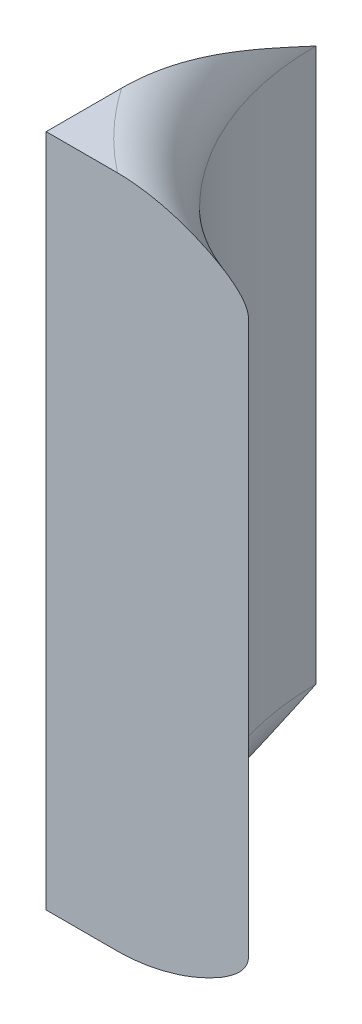
ISO-10303-21;
HEADER;
FILE_DESCRIPTION(('STEP AP214'),'2;1');
FILE_NAME('part.step','',(''),(''),'','','');
FILE_SCHEMA(('AUTOMOTIVE_DESIGN { 1 0 10303 214 1 1 1 1 }'));
ENDSEC;
DATA;
#1=APPLICATION_CONTEXT('core data for automotive mechanical design processes');
#2=APPLICATION_PROTOCOL_DEFINITION('international standard','automotive_design',2000,#1);
#3=PRODUCT_CONTEXT('',#1,'mechanical');
#4=PRODUCT('Part','Part','',(#3));
#5=PRODUCT_RELATED_PRODUCT_CATEGORY('part','',(#4));
#6=PRODUCT_DEFINITION_FORMATION('','',#4);
#7=PRODUCT_DEFINITION_CONTEXT('part definition',#1,'design');
#8=PRODUCT_DEFINITION('design','',#6,#7);
#9=PRODUCT_DEFINITION_SHAPE('','',#8);
#10=(LENGTH_UNIT() NAMED_UNIT(*) SI_UNIT(.MILLI.,.METRE.));
#11=(NAMED_UNIT(*) PLANE_ANGLE_UNIT() SI_UNIT($,.RADIAN.));
#12=(NAMED_UNIT(*) SI_UNIT($,.STERADIAN.) SOLID_ANGLE_UNIT());
#13=UNCERTAINTY_MEASURE_WITH_UNIT(LENGTH_MEASURE(1.E-05),#10,'distance_accuracy_value','');
#14=(GEOMETRIC_REPRESENTATION_CONTEXT(3) GLOBAL_UNCERTAINTY_ASSIGNED_CONTEXT((#13)) GLOBAL_UNIT_ASSIGNED_CONTEXT((#10,
#11,#12)) REPRESENTATION_CONTEXT('',''));
#15=CARTESIAN_POINT('',(0.,0.,0.));
#16=DIRECTION('',(0.,0.,1.));
#17=DIRECTION('',(1.,0.,0.));
#18=AXIS2_PLACEMENT_3D('',#15,#16,#17);
#19=CARTESIAN_POINT('',(10.4166666667,-1.59,-7.39999999999999));
#20=DIRECTION('',(0.,1.,0.));
#21=DIRECTION('',(0.,0.,1.));
#22=AXIS2_PLACEMENT_3D('',#19,#20,#21);
#23=TOROIDAL_SURFACE('',#22,0.506666666666962,0.0900000000000044);
#24=CARTESIAN_POINT('',(10.,-1.5,-7.11172929391627));
#25=CARTESIAN_POINT('',(9.99999999999954,-1.50000817152898,-7.1222642072621));
#26=CARTESIAN_POINT('',(9.99999999999977,-1.50059717561132,-7.13277700139159));
#27=CARTESIAN_POINT('',(10.0000000000002,-1.50273400876803,-7.15367604087888));
#28=CARTESIAN_POINT('',(10.0000000000005,-1.50427897807605,-7.16406256981069));
#29=CARTESIAN_POINT('',(9.99999999999909,-1.51000691356543,-7.19476484201054));
#30=CARTESIAN_POINT('',(9.99999999999548,-1.51529255151877,-7.21486900461544));
#31=CARTESIAN_POINT('',(10.0000000000063,-1.53025199544145,-7.2624459869253));
#32=CARTESIAN_POINT('',(10.0000000000287,-1.54083593428553,-7.28961338283889));
#33=CARTESIAN_POINT('',(9.99999999997119,-1.56369108787353,-7.34329374608189));
#34=CARTESIAN_POINT('',(9.99999999989093,-1.57596819427225,-7.36980402929141));
#35=CARTESIAN_POINT('',(10.0000000000051,-1.58885292511685,-7.39753187956105));
#36=CARTESIAN_POINT('',(10.0000000000106,-1.58942646567589,-7.39876593945821));
#37=CARTESIAN_POINT('',(10.0000000000165,-1.59,-7.39999999999999));
#38=B_SPLINE_CURVE_WITH_KNOTS('',3,(#24,#25,#26,#27,#28,#29,#30,#31,#32,#33,#34,#35,#36,#37),
.UNSPECIFIED.,.F.,.F.,(4,2,2,2,2,2,4),(0.,0.0315568755872305,0.0630198022804675,
0.12521648332746,0.212547911361559,0.30019127358529,0.304273756560981),.UNSPECIFIED.);
#39=CARTESIAN_POINT('',(10.,-1.5,-7.11172929392793));
#40=VERTEX_POINT('',#39);
#41=CARTESIAN_POINT('',(10.0000000000165,-1.59,-7.4));
#42=VERTEX_POINT('',#41);
#43=EDGE_CURVE('E67',#40,#42,#38,.T.);
#44=ORIENTED_EDGE('',*,*,#43,.F.);
#45=CARTESIAN_POINT('',(10.4166666667,-1.5,-7.39999999999999));
#46=DIRECTION('',(0.,1.,0.));
#47=DIRECTION('',(0.,0.,1.));
#48=AXIS2_PLACEMENT_3D('',#45,#46,#47);
#49=CIRCLE('',#48,0.506666666666964);
#50=CARTESIAN_POINT('',(10.1056825656205,-1.5,-7.));
#51=VERTEX_POINT('',#50);
#52=EDGE_CURVE('E21',#51,#40,#49,.F.);
#53=ORIENTED_EDGE('',*,*,#52,.F.);
#54=CARTESIAN_POINT('',(10.3000000000322,-1.59,-7.));
#55=CARTESIAN_POINT('',(10.3000075771629,-1.58820255979553,-7.));
#56=CARTESIAN_POINT('',(10.2998079863507,-1.58641802016421,-7.));
#57=CARTESIAN_POINT('',(10.2990729896061,-1.58295402144103,-7.));
#58=CARTESIAN_POINT('',(10.2985442314674,-1.58127318943097,-7.));
#59=CARTESIAN_POINT('',(10.2970169233432,-1.57751190526442,-7.));
#60=CARTESIAN_POINT('',(10.2959230121808,-1.57547160041114,-7.));
#61=CARTESIAN_POINT('',(10.2934314477972,-1.57156952362005,-7.));
#62=CARTESIAN_POINT('',(10.2920311893352,-1.56970949361495,-7.));
#63=CARTESIAN_POINT('',(10.2867640941098,-1.56343589457284,-7.));
#64=CARTESIAN_POINT('',(10.2823935945664,-1.55945631908828,-7.));
#65=CARTESIAN_POINT('',(10.2731737475397,-1.55211047927651,-7.));
#66=CARTESIAN_POINT('',(10.2683218557312,-1.54874777403988,-7.));
#67=CARTESIAN_POINT('',(10.2563237931637,-1.54117300054281,-7.));
#68=CARTESIAN_POINT('',(10.2490450564538,-1.53716940755816,-7.));
#69=CARTESIAN_POINT('',(10.2341745878263,-1.52978675279657,-7.));
#70=CARTESIAN_POINT('',(10.2265823203102,-1.52640881877296,-7.));
#71=CARTESIAN_POINT('',(10.2035011341585,-1.51713104815477,-7.));
#72=CARTESIAN_POINT('',(10.1876652281305,-1.51206245620279,-7.));
#73=CARTESIAN_POINT('',(10.1607436195396,-1.50561305222996,-7.));
#74=CARTESIAN_POINT('',(10.1498141409633,-1.50356728699318,-7.));
#75=CARTESIAN_POINT('',(10.1278279480941,-1.50076938935797,-7.));
#76=CARTESIAN_POINT('',(10.1167717147523,-1.50001338863394,-7.));
#77=CARTESIAN_POINT('',(10.1056825656226,-1.5,-7.));
#78=B_SPLINE_CURVE_WITH_KNOTS('',3,(#54,#55,#56,#57,#58,#59,#60,#61,#62,#63,#64,#65,#66,#67,#68,
#69,#70,#71,#72,#73,#74,#75,#76,#77),.UNSPECIFIED.,.F.,.F.,(4,2,2,2,2,2,2,2,2,2,2,4),(0.,
0.0053607538232027,0.0106166062475337,0.017522032571639,0.0244886399425397,0.0420846993037769,
0.0597792898738501,0.0846486742987746,0.109562458701946,0.159243487630375,0.192536219062483,
0.225728920588602),.UNSPECIFIED.);
#79=CARTESIAN_POINT('',(10.3000000000161,-1.59,-7.));
#80=VERTEX_POINT('',#79);
#81=EDGE_CURVE('E64',#80,#51,#78,.T.);
#82=ORIENTED_EDGE('',*,*,#81,.F.);
#83=CARTESIAN_POINT('',(10.4166666667,-1.59,-7.4));
#84=DIRECTION('',(0.,1.,0.));
#85=DIRECTION('',(0.,0.,1.));
#86=AXIS2_PLACEMENT_3D('',#83,#84,#85);
#87=CIRCLE('',#86,0.416666666666995);
#88=EDGE_CURVE('E71',#42,#80,#87,.T.);
#89=ORIENTED_EDGE('',*,*,#88,.F.);
#90=EDGE_LOOP('',(#44,#53,#82,#89));
#91=FACE_BOUND('',#90,.T.);
#92=ADVANCED_FACE('F17',(#91),#23,.T.);
#93=CARTESIAN_POINT('',(9.999,-1.5,-7.11272929390606));
#94=DIRECTION('',(0.,1.,0.));
#95=DIRECTION('',(0.,0.,1.));
#96=AXIS2_PLACEMENT_3D('',#93,#94,#95);
#97=PLANE('',#96);
#98=DIRECTION('',(-1.,0.,0.));
#99=VECTOR('',#98,1.);
#100=CARTESIAN_POINT('',(10.150000000016,-1.5,-7.));
#101=LINE('',#100,#99);
#102=CARTESIAN_POINT('',(10.,-1.5,-7.));
#103=VERTEX_POINT('',#102);
#104=EDGE_CURVE('E73',#51,#103,#101,.T.);
#105=ORIENTED_EDGE('',*,*,#104,.F.);
#106=ORIENTED_EDGE('',*,*,#52,.T.);
#107=DIRECTION('',(0.,0.,-1.));
#108=VECTOR('',#107,1.);
#109=CARTESIAN_POINT('',(10.,-1.5,-7.20651106315701));
#110=LINE('',#109,#108);
#111=EDGE_CURVE('E75',#103,#40,#110,.T.);
#112=ORIENTED_EDGE('',*,*,#111,.F.);
#113=EDGE_LOOP('',(#105,#106,#112));
#114=FACE_BOUND('',#113,.T.);
#115=ADVANCED_FACE('F74',(#114),#97,.T.);
#116=CARTESIAN_POINT('',(10.4166666667,-1.59,-7.4));
#117=DIRECTION('',(0.,-1.,0.));
#118=DIRECTION('',(0.,0.,-1.));
#119=AXIS2_PLACEMENT_3D('',#116,#117,#118);
#120=CYLINDRICAL_SURFACE('',#119,0.416666666666995);
#121=CARTESIAN_POINT('',(10.4166666667,-2.41,-7.39999999999997));
#122=DIRECTION('',(0.,1.,0.));
#123=DIRECTION('',(0.,0.,1.));
#124=AXIS2_PLACEMENT_3D('',#121,#122,#123);
#125=CIRCLE('',#124,0.416666666666956);
#126=CARTESIAN_POINT('',(10.0000000000165,-2.41,-7.4));
#127=VERTEX_POINT('',#126);
#128=CARTESIAN_POINT('',(10.3000000000161,-2.41,-7.));
#129=VERTEX_POINT('',#128);
#130=EDGE_CURVE('E122',#127,#129,#125,.T.);
#131=ORIENTED_EDGE('',*,*,#130,.F.);
#132=DIRECTION('',(0.,-1.,0.));
#133=VECTOR('',#132,1.);
#134=CARTESIAN_POINT('',(10.,-1.9999999999957,-7.4));
#135=LINE('',#134,#133);
#136=EDGE_CURVE('E82',#42,#127,#135,.T.);
#137=ORIENTED_EDGE('',*,*,#136,.F.);
#138=ORIENTED_EDGE('',*,*,#88,.T.);
#139=DIRECTION('',(0.,1.,0.));
#140=VECTOR('',#139,1.);
#141=CARTESIAN_POINT('',(10.3,-2.00000000000137,-7.));
#142=LINE('',#141,#140);
#143=EDGE_CURVE('E78',#129,#80,#142,.T.);
#144=ORIENTED_EDGE('',*,*,#143,.F.);
#145=EDGE_LOOP('',(#131,#137,#138,#144));
#146=FACE_BOUND('',#145,.T.);
#147=ADVANCED_FACE('F102',(#146),#120,.F.);
#148=CARTESIAN_POINT('',(9.999,-1.49899999999602,-7.));
#149=DIRECTION('',(0.,0.,1.));
#150=DIRECTION('',(0.,-1.,0.));
#151=AXIS2_PLACEMENT_3D('',#148,#149,#150);
#152=PLANE('',#151);
#153=ORIENTED_EDGE('',*,*,#143,.T.);
#154=ORIENTED_EDGE('',*,*,#81,.T.);
#155=ORIENTED_EDGE('',*,*,#104,.T.);
#156=DIRECTION('',(0.,1.,0.));
#157=VECTOR('',#156,1.);
#158=CARTESIAN_POINT('',(10.,-1.9999999999957,-7.));
#159=LINE('',#158,#157);
#160=CARTESIAN_POINT('',(10.,-2.5,-7.));
#161=VERTEX_POINT('',#160);
#162=EDGE_CURVE('E133',#161,#103,#159,.T.);
#163=ORIENTED_EDGE('',*,*,#162,.F.);
#164=DIRECTION('',(-1.,0.,0.));
#165=VECTOR('',#164,1.);
#166=CARTESIAN_POINT('',(10.0528412828078,-2.5,-7.));
#167=LINE('',#166,#165);
#168=CARTESIAN_POINT('',(10.1056825656205,-2.50000000000001,-7.));
#169=VERTEX_POINT('',#168);
#170=EDGE_CURVE('E120',#169,#161,#167,.T.);
#171=ORIENTED_EDGE('',*,*,#170,.F.);
#172=CARTESIAN_POINT('',(10.3000000000321,-2.41,-7.));
#173=CARTESIAN_POINT('',(10.3000075771628,-2.41179744020447,-7.));
#174=CARTESIAN_POINT('',(10.2998079863506,-2.4135819798358,-7.));
#175=CARTESIAN_POINT('',(10.299072989606,-2.41704597855898,-7.));
#176=CARTESIAN_POINT('',(10.2985442314673,-2.41872681056904,-7.));
#177=CARTESIAN_POINT('',(10.2970169233431,-2.42248809473559,-7.));
#178=CARTESIAN_POINT('',(10.2959230121807,-2.42452839958887,-7.));
#179=CARTESIAN_POINT('',(10.2934314477971,-2.42843047637996,-7.));
#180=CARTESIAN_POINT('',(10.2920311893351,-2.43029050638507,-7.));
#181=CARTESIAN_POINT('',(10.2867640941098,-2.43656410542718,-7.));
#182=CARTESIAN_POINT('',(10.2823935945663,-2.44054368091174,-7.));
#183=CARTESIAN_POINT('',(10.2731737475396,-2.44788952072352,-7.));
#184=CARTESIAN_POINT('',(10.2683218557311,-2.45125222596015,-7.));
#185=CARTESIAN_POINT('',(10.2563237931636,-2.45882699945722,-7.));
#186=CARTESIAN_POINT('',(10.2490450564537,-2.46283059244187,-7.));
#187=CARTESIAN_POINT('',(10.2341745878262,-2.47021324720345,-7.));
#188=CARTESIAN_POINT('',(10.2265823203101,-2.47359118122707,-7.));
#189=CARTESIAN_POINT('',(10.2035011341584,-2.48286895184526,-7.));
#190=CARTESIAN_POINT('',(10.1876652281304,-2.48793754379723,-7.));
#191=CARTESIAN_POINT('',(10.1607436195395,-2.49438694777006,-7.));
#192=CARTESIAN_POINT('',(10.1498141409633,-2.49643271300684,-7.));
#193=CARTESIAN_POINT('',(10.127827948094,-2.49923061064205,-7.));
#194=CARTESIAN_POINT('',(10.1167717147523,-2.49998661136608,-7.));
#195=CARTESIAN_POINT('',(10.1056825656226,-2.50000000000003,-7.));
#196=B_SPLINE_CURVE_WITH_KNOTS('',3,(#172,#173,#174,#175,#176,#177,#178,#179,#180,#181,#182,
#183,#184,#185,#186,#187,#188,#189,#190,#191,#192,#193,#194,#195),.UNSPECIFIED.,.F.,.F.,(4,2,2,
2,2,2,2,2,2,2,2,4),(0.,0.00536075382320719,0.0106166062475423,0.0175220325716544,
0.0244886399425584,0.0420846993037997,0.0597792898738809,0.0846486742987965,0.109562458701959,
0.159243487630376,0.192536219062446,0.225728920588531),.UNSPECIFIED.);
#197=EDGE_CURVE('E132',#129,#169,#196,.T.);
#198=ORIENTED_EDGE('',*,*,#197,.F.);
#199=EDGE_LOOP('',(#153,#154,#155,#163,#171,#198));
#200=FACE_BOUND('',#199,.T.);
#201=ADVANCED_FACE('F80',(#200),#152,.T.);
#202=CARTESIAN_POINT('',(10.,-2.50100000000859,-6.999));
#203=DIRECTION('',(-1.,0.,0.));
#204=DIRECTION('',(0.,1.,0.));
#205=AXIS2_PLACEMENT_3D('',#202,#203,#204);
#206=PLANE('',#205);
#207=ORIENTED_EDGE('',*,*,#162,.T.);
#208=ORIENTED_EDGE('',*,*,#111,.T.);
#209=ORIENTED_EDGE('',*,*,#43,.T.);
#210=ORIENTED_EDGE('',*,*,#136,.T.);
#211=CARTESIAN_POINT('',(10.,-2.50000000000003,-7.11172929391627));
#212=CARTESIAN_POINT('',(9.99999999999954,-2.49999182847104,-7.12226420726212));
#213=CARTESIAN_POINT('',(9.99999999999977,-2.49940282438869,-7.13277700139163));
#214=CARTESIAN_POINT('',(10.0000000000002,-2.49726599123198,-7.15367604087895));
#215=CARTESIAN_POINT('',(10.0000000000005,-2.49572102192395,-7.16406256981077));
#216=CARTESIAN_POINT('',(9.99999999999909,-2.48999308643456,-7.19476484201062));
#217=CARTESIAN_POINT('',(9.99999999999548,-2.4847074484812,-7.2148690046155));
#218=CARTESIAN_POINT('',(10.0000000000064,-2.46974800455856,-7.26244598692535));
#219=CARTESIAN_POINT('',(10.0000000000287,-2.45916406571457,-7.28961338283897));
#220=CARTESIAN_POINT('',(9.99999999997116,-2.43630891212636,-7.34329374608184));
#221=CARTESIAN_POINT('',(9.99999999989081,-2.42403180572735,-7.36980402929121));
#222=CARTESIAN_POINT('',(10.0000000000051,-2.41114707488312,-7.39753187956102));
#223=CARTESIAN_POINT('',(10.0000000000106,-2.41057353432409,-7.39876593945818));
#224=CARTESIAN_POINT('',(10.0000000000165,-2.41,-7.39999999999997));
#225=B_SPLINE_CURVE_WITH_KNOTS('',3,(#211,#212,#213,#214,#215,#216,#217,#218,#219,#220,#221,
#222,#223,#224),.UNSPECIFIED.,.F.,.F.,(4,2,2,2,2,2,4),(0.,0.0315568755872813,0.0630198022805621,
0.125216483327524,0.212547911361572,0.300191273585279,0.304273756560969),.UNSPECIFIED.);
#226=CARTESIAN_POINT('',(10.,-2.50000000000003,-7.11172929392796));
#227=VERTEX_POINT('',#226);
#228=EDGE_CURVE('E36',#227,#127,#225,.T.);
#229=ORIENTED_EDGE('',*,*,#228,.F.);
#230=DIRECTION('',(0.,0.,-1.));
#231=VECTOR('',#230,1.);
#232=CARTESIAN_POINT('',(10.,-2.5,-7.05586464695303));
#233=LINE('',#232,#231);
#234=EDGE_CURVE('E27',#161,#227,#233,.T.);
#235=ORIENTED_EDGE('',*,*,#234,.F.);
#236=EDGE_LOOP('',(#207,#208,#209,#210,#229,#235));
#237=FACE_BOUND('',#236,.T.);
#238=ADVANCED_FACE('F109',(#237),#206,.T.);
#239=CARTESIAN_POINT('',(10.4166666667,-2.41,-7.39999999999997));
#240=DIRECTION('',(0.,-1.,0.));
#241=DIRECTION('',(0.,0.,-1.));
#242=AXIS2_PLACEMENT_3D('',#239,#240,#241);
#243=TOROIDAL_SURFACE('',#242,0.506666666666997,0.0900000000000282);
#244=ORIENTED_EDGE('',*,*,#228,.T.);
#245=ORIENTED_EDGE('',*,*,#130,.T.);
#246=ORIENTED_EDGE('',*,*,#197,.T.);
#247=CARTESIAN_POINT('',(10.4166666667,-2.50000000000003,-7.39999999999997));
#248=DIRECTION('',(0.,-1.,0.));
#249=DIRECTION('',(0.,0.,-1.));
#250=AXIS2_PLACEMENT_3D('',#247,#248,#249);
#251=CIRCLE('',#250,0.50666666666693);
#252=EDGE_CURVE('E11',#227,#169,#251,.F.);
#253=ORIENTED_EDGE('',*,*,#252,.F.);
#254=EDGE_LOOP('',(#244,#245,#246,#253));
#255=FACE_BOUND('',#254,.T.);
#256=ADVANCED_FACE('F112',(#255),#243,.T.);
#257=CARTESIAN_POINT('',(9.999,-2.5,-6.999));
#258=DIRECTION('',(0.,-1.,0.));
#259=DIRECTION('',(0.,0.,-1.));
#260=AXIS2_PLACEMENT_3D('',#257,#258,#259);
#261=PLANE('',#260);
#262=ORIENTED_EDGE('',*,*,#234,.T.);
#263=ORIENTED_EDGE('',*,*,#252,.T.);
#264=ORIENTED_EDGE('',*,*,#170,.T.);
#265=EDGE_LOOP('',(#262,#263,#264));
#266=FACE_BOUND('',#265,.T.);
#267=ADVANCED_FACE('F19',(#266),#261,.T.);
#268=CLOSED_SHELL('',(#92,#115,#147,#201,#238,#256,#267));
#269=MANIFOLD_SOLID_BREP('B1',#268);
#270=ADVANCED_BREP_SHAPE_REPRESENTATION('',(#18,#269),#14);
#271=SHAPE_DEFINITION_REPRESENTATION(#9,#270);
ENDSEC;
END-ISO-10303-21;
